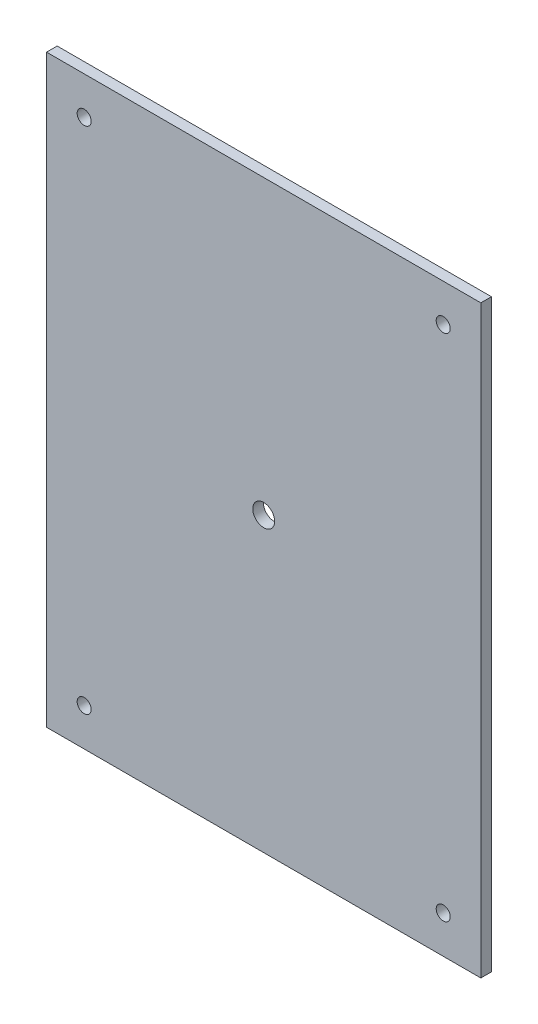
ISO-10303-21;
HEADER;
FILE_DESCRIPTION(('STEP AP214'),'2;1');
FILE_NAME('part.step','',(''),(''),'','','');
FILE_SCHEMA(('AUTOMOTIVE_DESIGN { 1 0 10303 214 1 1 1 1 }'));
ENDSEC;
DATA;
#1=APPLICATION_CONTEXT('core data for automotive mechanical design processes');
#2=APPLICATION_PROTOCOL_DEFINITION('international standard','automotive_design',2000,#1);
#3=PRODUCT_CONTEXT('',#1,'mechanical');
#4=PRODUCT('Part','Part','',(#3));
#5=PRODUCT_RELATED_PRODUCT_CATEGORY('part','',(#4));
#6=PRODUCT_DEFINITION_FORMATION('','',#4);
#7=PRODUCT_DEFINITION_CONTEXT('part definition',#1,'design');
#8=PRODUCT_DEFINITION('design','',#6,#7);
#9=PRODUCT_DEFINITION_SHAPE('','',#8);
#10=(LENGTH_UNIT() NAMED_UNIT(*) SI_UNIT(.MILLI.,.METRE.));
#11=(NAMED_UNIT(*) PLANE_ANGLE_UNIT() SI_UNIT($,.RADIAN.));
#12=(NAMED_UNIT(*) SI_UNIT($,.STERADIAN.) SOLID_ANGLE_UNIT());
#13=UNCERTAINTY_MEASURE_WITH_UNIT(LENGTH_MEASURE(1.E-05),#10,'distance_accuracy_value','');
#14=(GEOMETRIC_REPRESENTATION_CONTEXT(3) GLOBAL_UNCERTAINTY_ASSIGNED_CONTEXT((#13)) GLOBAL_UNIT_ASSIGNED_CONTEXT((#10,
#11,#12)) REPRESENTATION_CONTEXT('',''));
#15=CARTESIAN_POINT('',(0.,0.,0.));
#16=DIRECTION('',(0.,0.,1.));
#17=DIRECTION('',(1.,0.,0.));
#18=AXIS2_PLACEMENT_3D('',#15,#16,#17);
#19=CARTESIAN_POINT('',(0.,349.8,6.35));
#20=DIRECTION('',(-1.,0.,0.));
#21=DIRECTION('',(0.,-1.,0.));
#22=AXIS2_PLACEMENT_3D('',#19,#20,#21);
#23=PLANE('',#22);
#24=DIRECTION('',(0.,1.,0.));
#25=VECTOR('',#24,1.);
#26=CARTESIAN_POINT('',(0.,349.8,0.));
#27=LINE('',#26,#25);
#28=CARTESIAN_POINT('',(0.,0.,0.));
#29=VERTEX_POINT('',#28);
#30=CARTESIAN_POINT('',(0.,349.8,0.));
#31=VERTEX_POINT('',#30);
#32=EDGE_CURVE('E110',#29,#31,#27,.T.);
#33=ORIENTED_EDGE('',*,*,#32,.T.);
#34=DIRECTION('',(0.,0.,-1.));
#35=VECTOR('',#34,1.);
#36=CARTESIAN_POINT('',(0.,349.8,6.35));
#37=LINE('',#36,#35);
#38=CARTESIAN_POINT('',(0.,349.8,6.35));
#39=VERTEX_POINT('',#38);
#40=EDGE_CURVE('E11',#39,#31,#37,.T.);
#41=ORIENTED_EDGE('',*,*,#40,.F.);
#42=DIRECTION('',(0.,1.,0.));
#43=VECTOR('',#42,1.);
#44=CARTESIAN_POINT('',(0.,349.8,6.35));
#45=LINE('',#44,#43);
#46=CARTESIAN_POINT('',(0.,0.,6.35));
#47=VERTEX_POINT('',#46);
#48=EDGE_CURVE('E93',#47,#39,#45,.T.);
#49=ORIENTED_EDGE('',*,*,#48,.F.);
#50=DIRECTION('',(0.,0.,-1.));
#51=VECTOR('',#50,1.);
#52=CARTESIAN_POINT('',(0.,0.,6.35));
#53=LINE('',#52,#51);
#54=EDGE_CURVE('E106',#47,#29,#53,.T.);
#55=ORIENTED_EDGE('',*,*,#54,.T.);
#56=EDGE_LOOP('',(#33,#41,#49,#55));
#57=FACE_BOUND('',#56,.T.);
#58=ADVANCED_FACE('F39',(#57),#23,.F.);
#59=CARTESIAN_POINT('',(-259.8,349.8,6.35));
#60=DIRECTION('',(0.,-1.,0.));
#61=DIRECTION('',(1.,0.,0.));
#62=AXIS2_PLACEMENT_3D('',#59,#60,#61);
#63=PLANE('',#62);
#64=DIRECTION('',(-1.,0.,0.));
#65=VECTOR('',#64,1.);
#66=CARTESIAN_POINT('',(-259.8,349.8,0.));
#67=LINE('',#66,#65);
#68=CARTESIAN_POINT('',(-259.8,349.8,0.));
#69=VERTEX_POINT('',#68);
#70=EDGE_CURVE('E98',#31,#69,#67,.T.);
#71=ORIENTED_EDGE('',*,*,#70,.T.);
#72=DIRECTION('',(0.,0.,-1.));
#73=VECTOR('',#72,1.);
#74=CARTESIAN_POINT('',(-259.8,349.8,6.35));
#75=LINE('',#74,#73);
#76=CARTESIAN_POINT('',(-259.8,349.8,6.35));
#77=VERTEX_POINT('',#76);
#78=EDGE_CURVE('E49',#77,#69,#75,.T.);
#79=ORIENTED_EDGE('',*,*,#78,.F.);
#80=DIRECTION('',(-1.,0.,0.));
#81=VECTOR('',#80,1.);
#82=CARTESIAN_POINT('',(-259.8,349.8,6.35));
#83=LINE('',#82,#81);
#84=EDGE_CURVE('E88',#39,#77,#83,.T.);
#85=ORIENTED_EDGE('',*,*,#84,.F.);
#86=ORIENTED_EDGE('',*,*,#40,.T.);
#87=EDGE_LOOP('',(#71,#79,#85,#86));
#88=FACE_BOUND('',#87,.T.);
#89=ADVANCED_FACE('F97',(#88),#63,.F.);
#90=CARTESIAN_POINT('',(-259.8,0.,6.35));
#91=DIRECTION('',(1.,0.,0.));
#92=DIRECTION('',(0.,0.,-1.));
#93=AXIS2_PLACEMENT_3D('',#90,#91,#92);
#94=PLANE('',#93);
#95=DIRECTION('',(0.,-1.,0.));
#96=VECTOR('',#95,1.);
#97=CARTESIAN_POINT('',(-259.8,0.,0.));
#98=LINE('',#97,#96);
#99=CARTESIAN_POINT('',(-259.8,0.,0.));
#100=VERTEX_POINT('',#99);
#101=EDGE_CURVE('E75',#69,#100,#98,.T.);
#102=ORIENTED_EDGE('',*,*,#101,.T.);
#103=DIRECTION('',(0.,0.,-1.));
#104=VECTOR('',#103,1.);
#105=CARTESIAN_POINT('',(-259.8,0.,6.35));
#106=LINE('',#105,#104);
#107=CARTESIAN_POINT('',(-259.8,0.,6.35));
#108=VERTEX_POINT('',#107);
#109=EDGE_CURVE('E100',#108,#100,#106,.T.);
#110=ORIENTED_EDGE('',*,*,#109,.F.);
#111=DIRECTION('',(0.,-1.,0.));
#112=VECTOR('',#111,1.);
#113=CARTESIAN_POINT('',(-259.8,0.,6.35));
#114=LINE('',#113,#112);
#115=EDGE_CURVE('E91',#77,#108,#114,.T.);
#116=ORIENTED_EDGE('',*,*,#115,.F.);
#117=ORIENTED_EDGE('',*,*,#78,.T.);
#118=EDGE_LOOP('',(#102,#110,#116,#117));
#119=FACE_BOUND('',#118,.T.);
#120=ADVANCED_FACE('F102',(#119),#94,.F.);
#121=CARTESIAN_POINT('',(0.,0.,6.35));
#122=DIRECTION('',(0.,1.,0.));
#123=DIRECTION('',(0.,0.,1.));
#124=AXIS2_PLACEMENT_3D('',#121,#122,#123);
#125=PLANE('',#124);
#126=DIRECTION('',(1.,0.,0.));
#127=VECTOR('',#126,1.);
#128=CARTESIAN_POINT('',(0.,0.,0.));
#129=LINE('',#128,#127);
#130=EDGE_CURVE('E81',#100,#29,#129,.T.);
#131=ORIENTED_EDGE('',*,*,#130,.T.);
#132=ORIENTED_EDGE('',*,*,#54,.F.);
#133=DIRECTION('',(1.,0.,0.));
#134=VECTOR('',#133,1.);
#135=CARTESIAN_POINT('',(0.,0.,6.35));
#136=LINE('',#135,#134);
#137=EDGE_CURVE('E58',#108,#47,#136,.T.);
#138=ORIENTED_EDGE('',*,*,#137,.F.);
#139=ORIENTED_EDGE('',*,*,#109,.T.);
#140=EDGE_LOOP('',(#131,#132,#138,#139));
#141=FACE_BOUND('',#140,.T.);
#142=ADVANCED_FACE('F175',(#141),#125,.F.);
#143=CARTESIAN_POINT('',(0.,0.,6.35));
#144=DIRECTION('',(0.,0.,-1.));
#145=DIRECTION('',(-1.,0.,0.));
#146=AXIS2_PLACEMENT_3D('',#143,#144,#145);
#147=PLANE('',#146);
#148=CARTESIAN_POINT('',(-237.3,327.3,6.35));
#149=DIRECTION('',(0.,0.,1.));
#150=DIRECTION('',(1.,0.,0.));
#151=AXIS2_PLACEMENT_3D('',#148,#149,#150);
#152=CIRCLE('',#151,4.19999999999998);
#153=CARTESIAN_POINT('',(-233.1,327.3,6.35));
#154=VERTEX_POINT('',#153);
#155=EDGE_CURVE('E146',#154,#154,#152,.T.);
#156=ORIENTED_EDGE('',*,*,#155,.F.);
#157=EDGE_LOOP('',(#156));
#158=FACE_BOUND('',#157,.T.);
#159=CARTESIAN_POINT('',(-22.5,327.3,6.35));
#160=DIRECTION('',(0.,0.,1.));
#161=DIRECTION('',(1.,0.,0.));
#162=AXIS2_PLACEMENT_3D('',#159,#160,#161);
#163=CIRCLE('',#162,4.19999999999999);
#164=CARTESIAN_POINT('',(-18.3,327.3,6.35));
#165=VERTEX_POINT('',#164);
#166=EDGE_CURVE('E133',#165,#165,#163,.T.);
#167=ORIENTED_EDGE('',*,*,#166,.F.);
#168=EDGE_LOOP('',(#167));
#169=FACE_BOUND('',#168,.T.);
#170=CARTESIAN_POINT('',(-22.5,22.5000000000001,6.35));
#171=DIRECTION('',(0.,0.,1.));
#172=DIRECTION('',(1.,0.,0.));
#173=AXIS2_PLACEMENT_3D('',#170,#171,#172);
#174=CIRCLE('',#173,4.19999999999999);
#175=CARTESIAN_POINT('',(-18.3,22.5000000000001,6.35));
#176=VERTEX_POINT('',#175);
#177=EDGE_CURVE('E129',#176,#176,#174,.T.);
#178=ORIENTED_EDGE('',*,*,#177,.F.);
#179=EDGE_LOOP('',(#178));
#180=FACE_BOUND('',#179,.T.);
#181=CARTESIAN_POINT('',(-237.3,22.5000000000001,6.35));
#182=DIRECTION('',(0.,0.,1.));
#183=DIRECTION('',(1.,0.,0.));
#184=AXIS2_PLACEMENT_3D('',#181,#182,#183);
#185=CIRCLE('',#184,4.19999999999998);
#186=CARTESIAN_POINT('',(-233.1,22.5000000000001,6.35));
#187=VERTEX_POINT('',#186);
#188=EDGE_CURVE('E128',#187,#187,#185,.T.);
#189=ORIENTED_EDGE('',*,*,#188,.F.);
#190=EDGE_LOOP('',(#189));
#191=FACE_BOUND('',#190,.T.);
#192=CARTESIAN_POINT('',(-129.9,174.9,6.35));
#193=DIRECTION('',(0.,0.,1.));
#194=DIRECTION('',(1.,0.,0.));
#195=AXIS2_PLACEMENT_3D('',#192,#193,#194);
#196=CIRCLE('',#195,6.54811999999999);
#197=CARTESIAN_POINT('',(-123.35188,174.9,6.35));
#198=VERTEX_POINT('',#197);
#199=EDGE_CURVE('E156',#198,#198,#196,.T.);
#200=ORIENTED_EDGE('',*,*,#199,.F.);
#201=EDGE_LOOP('',(#200));
#202=FACE_BOUND('',#201,.T.);
#203=ORIENTED_EDGE('',*,*,#48,.T.);
#204=ORIENTED_EDGE('',*,*,#84,.T.);
#205=ORIENTED_EDGE('',*,*,#115,.T.);
#206=ORIENTED_EDGE('',*,*,#137,.T.);
#207=EDGE_LOOP('',(#203,#204,#205,#206));
#208=FACE_BOUND('',#207,.T.);
#209=ADVANCED_FACE('F89',(#158,#169,#180,#191,#202,#208),#147,.F.);
#210=CARTESIAN_POINT('',(0.,0.,0.));
#211=DIRECTION('',(0.,0.,-1.));
#212=DIRECTION('',(-1.,0.,0.));
#213=AXIS2_PLACEMENT_3D('',#210,#211,#212);
#214=PLANE('',#213);
#215=CARTESIAN_POINT('',(-237.3,327.3,0.));
#216=DIRECTION('',(0.,0.,-1.));
#217=DIRECTION('',(-1.,0.,0.));
#218=AXIS2_PLACEMENT_3D('',#215,#216,#217);
#219=CIRCLE('',#218,4.19999999999998);
#220=CARTESIAN_POINT('',(-241.5,327.3,0.));
#221=VERTEX_POINT('',#220);
#222=EDGE_CURVE('E42',#221,#221,#219,.T.);
#223=ORIENTED_EDGE('',*,*,#222,.F.);
#224=EDGE_LOOP('',(#223));
#225=FACE_BOUND('',#224,.T.);
#226=CARTESIAN_POINT('',(-22.5,327.3,0.));
#227=DIRECTION('',(0.,0.,-1.));
#228=DIRECTION('',(-1.,0.,0.));
#229=AXIS2_PLACEMENT_3D('',#226,#227,#228);
#230=CIRCLE('',#229,4.19999999999999);
#231=CARTESIAN_POINT('',(-26.7,327.3,0.));
#232=VERTEX_POINT('',#231);
#233=EDGE_CURVE('E130',#232,#232,#230,.T.);
#234=ORIENTED_EDGE('',*,*,#233,.F.);
#235=EDGE_LOOP('',(#234));
#236=FACE_BOUND('',#235,.T.);
#237=CARTESIAN_POINT('',(-22.5,22.5000000000001,0.));
#238=DIRECTION('',(0.,0.,-1.));
#239=DIRECTION('',(-1.,0.,0.));
#240=AXIS2_PLACEMENT_3D('',#237,#238,#239);
#241=CIRCLE('',#240,4.19999999999999);
#242=CARTESIAN_POINT('',(-26.7,22.5000000000001,0.));
#243=VERTEX_POINT('',#242);
#244=EDGE_CURVE('E125',#243,#243,#241,.T.);
#245=ORIENTED_EDGE('',*,*,#244,.F.);
#246=EDGE_LOOP('',(#245));
#247=FACE_BOUND('',#246,.T.);
#248=CARTESIAN_POINT('',(-237.3,22.5000000000001,0.));
#249=DIRECTION('',(0.,0.,-1.));
#250=DIRECTION('',(-1.,0.,0.));
#251=AXIS2_PLACEMENT_3D('',#248,#249,#250);
#252=CIRCLE('',#251,4.19999999999998);
#253=CARTESIAN_POINT('',(-241.5,22.5000000000001,0.));
#254=VERTEX_POINT('',#253);
#255=EDGE_CURVE('E152',#254,#254,#252,.T.);
#256=ORIENTED_EDGE('',*,*,#255,.F.);
#257=EDGE_LOOP('',(#256));
#258=FACE_BOUND('',#257,.T.);
#259=CARTESIAN_POINT('',(-129.9,174.9,0.));
#260=DIRECTION('',(0.,0.,-1.));
#261=DIRECTION('',(-1.,0.,0.));
#262=AXIS2_PLACEMENT_3D('',#259,#260,#261);
#263=CIRCLE('',#262,6.54811999999999);
#264=CARTESIAN_POINT('',(-136.44812,174.9,0.));
#265=VERTEX_POINT('',#264);
#266=EDGE_CURVE('E114',#265,#265,#263,.T.);
#267=ORIENTED_EDGE('',*,*,#266,.F.);
#268=EDGE_LOOP('',(#267));
#269=FACE_BOUND('',#268,.T.);
#270=ORIENTED_EDGE('',*,*,#32,.F.);
#271=ORIENTED_EDGE('',*,*,#130,.F.);
#272=ORIENTED_EDGE('',*,*,#101,.F.);
#273=ORIENTED_EDGE('',*,*,#70,.F.);
#274=EDGE_LOOP('',(#270,#271,#272,#273));
#275=FACE_BOUND('',#274,.T.);
#276=ADVANCED_FACE('F168',(#225,#236,#247,#258,#269,#275),#214,.T.);
#277=CARTESIAN_POINT('',(-129.9,174.9,6.35));
#278=DIRECTION('',(0.,0.,1.));
#279=DIRECTION('',(1.,0.,0.));
#280=AXIS2_PLACEMENT_3D('',#277,#278,#279);
#281=CYLINDRICAL_SURFACE('',#280,6.54811999999999);
#282=ORIENTED_EDGE('',*,*,#266,.T.);
#283=EDGE_LOOP('',(#282));
#284=FACE_BOUND('',#283,.T.);
#285=ORIENTED_EDGE('',*,*,#199,.T.);
#286=EDGE_LOOP('',(#285));
#287=FACE_BOUND('',#286,.T.);
#288=ADVANCED_FACE('F165',(#284,#287),#281,.F.);
#289=CARTESIAN_POINT('',(-237.3,22.5000000000001,6.35));
#290=DIRECTION('',(0.,0.,1.));
#291=DIRECTION('',(1.,0.,0.));
#292=AXIS2_PLACEMENT_3D('',#289,#290,#291);
#293=CYLINDRICAL_SURFACE('',#292,4.19999999999998);
#294=ORIENTED_EDGE('',*,*,#255,.T.);
#295=EDGE_LOOP('',(#294));
#296=FACE_BOUND('',#295,.T.);
#297=ORIENTED_EDGE('',*,*,#188,.T.);
#298=EDGE_LOOP('',(#297));
#299=FACE_BOUND('',#298,.T.);
#300=ADVANCED_FACE('F209',(#296,#299),#293,.F.);
#301=CARTESIAN_POINT('',(-22.5,22.5000000000001,6.35));
#302=DIRECTION('',(0.,0.,1.));
#303=DIRECTION('',(1.,0.,0.));
#304=AXIS2_PLACEMENT_3D('',#301,#302,#303);
#305=CYLINDRICAL_SURFACE('',#304,4.19999999999999);
#306=ORIENTED_EDGE('',*,*,#244,.T.);
#307=EDGE_LOOP('',(#306));
#308=FACE_BOUND('',#307,.T.);
#309=ORIENTED_EDGE('',*,*,#177,.T.);
#310=EDGE_LOOP('',(#309));
#311=FACE_BOUND('',#310,.T.);
#312=ADVANCED_FACE('F229',(#308,#311),#305,.F.);
#313=CARTESIAN_POINT('',(-22.5,327.3,6.35));
#314=DIRECTION('',(0.,0.,1.));
#315=DIRECTION('',(1.,0.,0.));
#316=AXIS2_PLACEMENT_3D('',#313,#314,#315);
#317=CYLINDRICAL_SURFACE('',#316,4.19999999999999);
#318=ORIENTED_EDGE('',*,*,#233,.T.);
#319=EDGE_LOOP('',(#318));
#320=FACE_BOUND('',#319,.T.);
#321=ORIENTED_EDGE('',*,*,#166,.T.);
#322=EDGE_LOOP('',(#321));
#323=FACE_BOUND('',#322,.T.);
#324=ADVANCED_FACE('F239',(#320,#323),#317,.F.);
#325=CARTESIAN_POINT('',(-237.3,327.3,6.35));
#326=DIRECTION('',(0.,0.,1.));
#327=DIRECTION('',(1.,0.,0.));
#328=AXIS2_PLACEMENT_3D('',#325,#326,#327);
#329=CYLINDRICAL_SURFACE('',#328,4.19999999999998);
#330=ORIENTED_EDGE('',*,*,#222,.T.);
#331=EDGE_LOOP('',(#330));
#332=FACE_BOUND('',#331,.T.);
#333=ORIENTED_EDGE('',*,*,#155,.T.);
#334=EDGE_LOOP('',(#333));
#335=FACE_BOUND('',#334,.T.);
#336=ADVANCED_FACE('F249',(#332,#335),#329,.F.);
#337=CLOSED_SHELL('',(#58,#89,#120,#142,#209,#276,#288,#300,#312,#324,#336));
#338=MANIFOLD_SOLID_BREP('B2',#337);
#339=ADVANCED_BREP_SHAPE_REPRESENTATION('',(#18,#338),#14);
#340=SHAPE_DEFINITION_REPRESENTATION(#9,#339);
ENDSEC;
END-ISO-10303-21;
